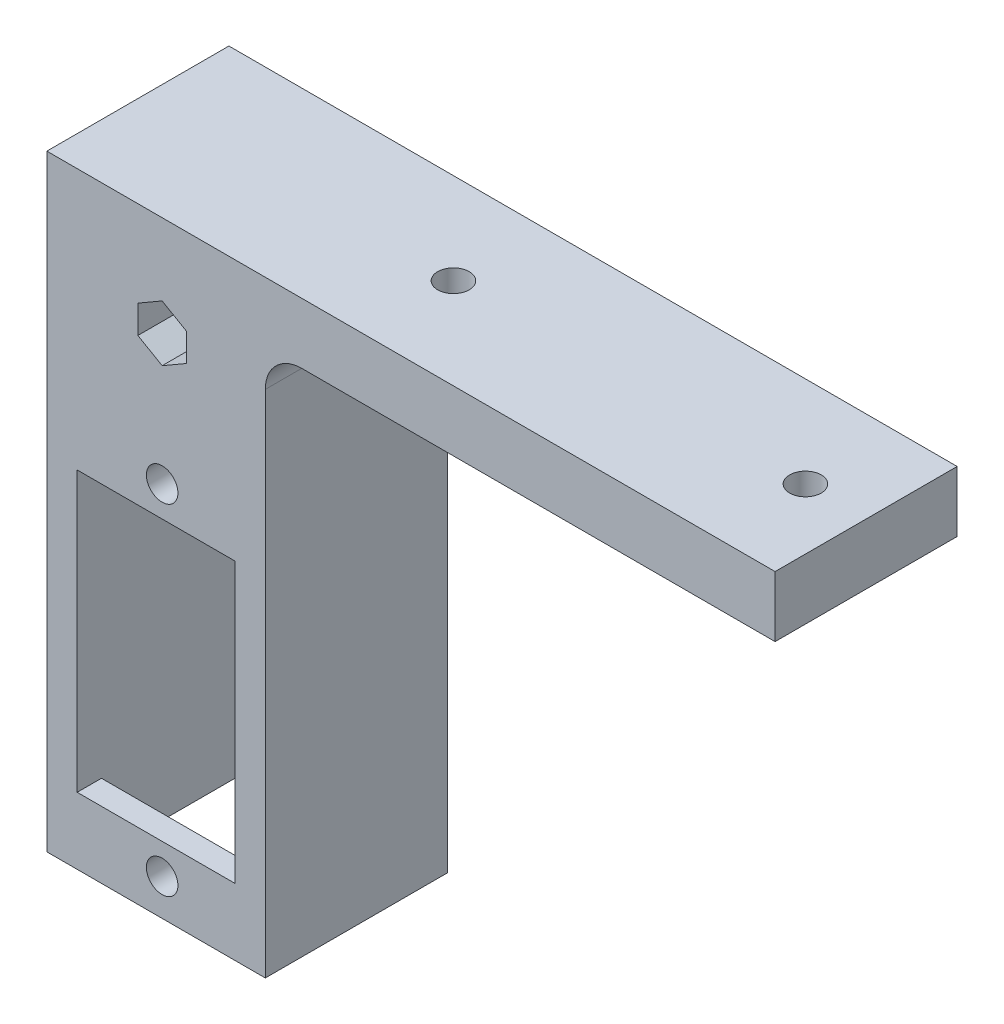
ISO-10303-21;
HEADER;
FILE_DESCRIPTION(('STEP AP214'),'2;1');
FILE_NAME('part.step','',(''),(''),'','','');
FILE_SCHEMA(('AUTOMOTIVE_DESIGN { 1 0 10303 214 1 1 1 1 }'));
ENDSEC;
DATA;
#1=APPLICATION_CONTEXT('core data for automotive mechanical design processes');
#2=APPLICATION_PROTOCOL_DEFINITION('international standard','automotive_design',2000,#1);
#3=PRODUCT_CONTEXT('',#1,'mechanical');
#4=PRODUCT('Part','Part','',(#3));
#5=PRODUCT_RELATED_PRODUCT_CATEGORY('part','',(#4));
#6=PRODUCT_DEFINITION_FORMATION('','',#4);
#7=PRODUCT_DEFINITION_CONTEXT('part definition',#1,'design');
#8=PRODUCT_DEFINITION('design','',#6,#7);
#9=PRODUCT_DEFINITION_SHAPE('','',#8);
#10=(LENGTH_UNIT() NAMED_UNIT(*) SI_UNIT(.MILLI.,.METRE.));
#11=(NAMED_UNIT(*) PLANE_ANGLE_UNIT() SI_UNIT($,.RADIAN.));
#12=(NAMED_UNIT(*) SI_UNIT($,.STERADIAN.) SOLID_ANGLE_UNIT());
#13=UNCERTAINTY_MEASURE_WITH_UNIT(LENGTH_MEASURE(1.E-05),#10,'distance_accuracy_value','');
#14=(GEOMETRIC_REPRESENTATION_CONTEXT(3) GLOBAL_UNCERTAINTY_ASSIGNED_CONTEXT((#13)) GLOBAL_UNIT_ASSIGNED_CONTEXT((#10,
#11,#12)) REPRESENTATION_CONTEXT('',''));
#15=CARTESIAN_POINT('',(0.,0.,0.));
#16=DIRECTION('',(0.,0.,1.));
#17=DIRECTION('',(1.,0.,0.));
#18=AXIS2_PLACEMENT_3D('',#15,#16,#17);
#19=CARTESIAN_POINT('',(-20.5000000000228,-5.75000000000239,15.001));
#20=DIRECTION('',(0.,0.,-1.));
#21=DIRECTION('',(-1.,0.,0.));
#22=AXIS2_PLACEMENT_3D('',#19,#20,#21);
#23=CYLINDRICAL_SURFACE('',#22,1.3);
#24=CARTESIAN_POINT('',(-20.5000000000228,-5.75000000000239,-4.));
#25=DIRECTION('',(0.,0.,-1.));
#26=DIRECTION('',(-1.,0.,0.));
#27=AXIS2_PLACEMENT_3D('',#24,#25,#26);
#28=CIRCLE('',#27,1.3);
#29=CARTESIAN_POINT('',(-21.8000000000228,-5.75000000000239,-4.));
#30=VERTEX_POINT('',#29);
#31=EDGE_CURVE('E238',#30,#30,#28,.T.);
#32=ORIENTED_EDGE('',*,*,#31,.T.);
#33=EDGE_LOOP('',(#32));
#34=FACE_BOUND('',#33,.T.);
#35=CARTESIAN_POINT('',(-20.5000000000228,-5.75000000000239,5.));
#36=DIRECTION('',(0.,0.,1.));
#37=DIRECTION('',(1.,0.,0.));
#38=AXIS2_PLACEMENT_3D('',#35,#36,#37);
#39=CIRCLE('',#38,1.3);
#40=CARTESIAN_POINT('',(-19.2000000000228,-5.75000000000239,5.));
#41=VERTEX_POINT('',#40);
#42=EDGE_CURVE('E230',#41,#41,#39,.F.);
#43=ORIENTED_EDGE('',*,*,#42,.F.);
#44=EDGE_LOOP('',(#43));
#45=FACE_BOUND('',#44,.T.);
#46=ADVANCED_FACE('F35',(#34,#45),#23,.F.);
#47=CARTESIAN_POINT('',(0.,0.,13.));
#48=DIRECTION('',(0.,0.,-1.));
#49=DIRECTION('',(-1.,0.,0.));
#50=AXIS2_PLACEMENT_3D('',#47,#48,#49);
#51=PLANE('',#50);
#52=CARTESIAN_POINT('',(-20.5,-16.5,13.));
#53=DIRECTION('',(0.,0.,-1.));
#54=DIRECTION('',(-1.,0.,0.));
#55=AXIS2_PLACEMENT_3D('',#52,#53,#54);
#56=CIRCLE('',#55,1.29999999999999);
#57=CARTESIAN_POINT('',(-21.8,-16.5,13.));
#58=VERTEX_POINT('',#57);
#59=EDGE_CURVE('E245',#58,#58,#56,.T.);
#60=ORIENTED_EDGE('',*,*,#59,.F.);
#61=EDGE_LOOP('',(#60));
#62=FACE_BOUND('',#61,.T.);
#63=DIRECTION('',(1.,0.,0.));
#64=VECTOR('',#63,1.);
#65=CARTESIAN_POINT('',(-14.5,-19.,13.));
#66=LINE('',#65,#64);
#67=CARTESIAN_POINT('',(-27.5,-19.,13.));
#68=VERTEX_POINT('',#67);
#69=CARTESIAN_POINT('',(-14.5,-19.,13.));
#70=VERTEX_POINT('',#69);
#71=EDGE_CURVE('E267',#68,#70,#66,.T.);
#72=ORIENTED_EDGE('',*,*,#71,.F.);
#73=DIRECTION('',(0.,1.,0.));
#74=VECTOR('',#73,1.);
#75=CARTESIAN_POINT('',(-27.5,-47.5,13.));
#76=LINE('',#75,#74);
#77=CARTESIAN_POINT('',(-27.5,-13.5,13.));
#78=VERTEX_POINT('',#77);
#79=EDGE_CURVE('E289',#68,#78,#76,.T.);
#80=ORIENTED_EDGE('',*,*,#79,.T.);
#81=DIRECTION('',(1.,0.,0.));
#82=VECTOR('',#81,1.);
#83=CARTESIAN_POINT('',(-27.5,-13.5,13.));
#84=LINE('',#83,#82);
#85=CARTESIAN_POINT('',(-14.5,-13.5,13.));
#86=VERTEX_POINT('',#85);
#87=EDGE_CURVE('E288',#78,#86,#84,.T.);
#88=ORIENTED_EDGE('',*,*,#87,.T.);
#89=DIRECTION('',(0.,1.,0.));
#90=VECTOR('',#89,1.);
#91=CARTESIAN_POINT('',(-14.5,-47.5,13.));
#92=LINE('',#91,#90);
#93=EDGE_CURVE('E292',#70,#86,#92,.T.);
#94=ORIENTED_EDGE('',*,*,#93,.F.);
#95=EDGE_LOOP('',(#72,#80,#88,#94));
#96=FACE_BOUND('',#95,.T.);
#97=ADVANCED_FACE('F401',(#62,#96),#51,.T.);
#98=CARTESIAN_POINT('',(30.,-2.5,15.));
#99=DIRECTION('',(-1.,0.,0.));
#100=DIRECTION('',(0.,0.,1.));
#101=AXIS2_PLACEMENT_3D('',#98,#99,#100);
#102=PLANE('',#101);
#103=DIRECTION('',(0.,1.,0.));
#104=VECTOR('',#103,1.);
#105=CARTESIAN_POINT('',(30.,-2.5,0.));
#106=LINE('',#105,#104);
#107=CARTESIAN_POINT('',(30.,-2.5,0.));
#108=VERTEX_POINT('',#107);
#109=CARTESIAN_POINT('',(30.,2.5,0.));
#110=VERTEX_POINT('',#109);
#111=EDGE_CURVE('E328',#108,#110,#106,.T.);
#112=ORIENTED_EDGE('',*,*,#111,.T.);
#113=DIRECTION('',(0.,0.,-1.));
#114=VECTOR('',#113,1.);
#115=CARTESIAN_POINT('',(30.,2.5,15.));
#116=LINE('',#115,#114);
#117=CARTESIAN_POINT('',(30.,2.5,15.));
#118=VERTEX_POINT('',#117);
#119=EDGE_CURVE('E369',#118,#110,#116,.T.);
#120=ORIENTED_EDGE('',*,*,#119,.F.);
#121=DIRECTION('',(0.,1.,0.));
#122=VECTOR('',#121,1.);
#123=CARTESIAN_POINT('',(30.,-2.5,15.));
#124=LINE('',#123,#122);
#125=CARTESIAN_POINT('',(30.,-2.5,15.));
#126=VERTEX_POINT('',#125);
#127=EDGE_CURVE('E329',#126,#118,#124,.T.);
#128=ORIENTED_EDGE('',*,*,#127,.F.);
#129=DIRECTION('',(0.,0.,-1.));
#130=VECTOR('',#129,1.);
#131=CARTESIAN_POINT('',(30.,-2.5,15.));
#132=LINE('',#131,#130);
#133=EDGE_CURVE('E343',#126,#108,#132,.T.);
#134=ORIENTED_EDGE('',*,*,#133,.T.);
#135=EDGE_LOOP('',(#112,#120,#128,#134));
#136=FACE_BOUND('',#135,.T.);
#137=ADVANCED_FACE('F389',(#136),#102,.F.);
#138=CARTESIAN_POINT('',(-30.,2.5,15.));
#139=DIRECTION('',(0.,-1.,0.));
#140=DIRECTION('',(0.,0.,-1.));
#141=AXIS2_PLACEMENT_3D('',#138,#139,#140);
#142=PLANE('',#141);
#143=CARTESIAN_POINT('',(25.,2.5,7.5));
#144=DIRECTION('',(0.,1.,0.));
#145=DIRECTION('',(0.,0.,1.));
#146=AXIS2_PLACEMENT_3D('',#143,#144,#145);
#147=CIRCLE('',#146,1.29999999999999);
#148=CARTESIAN_POINT('',(25.,2.5,8.79999999999999));
#149=VERTEX_POINT('',#148);
#150=EDGE_CURVE('E309',#149,#149,#147,.T.);
#151=ORIENTED_EDGE('',*,*,#150,.F.);
#152=EDGE_LOOP('',(#151));
#153=FACE_BOUND('',#152,.T.);
#154=CARTESIAN_POINT('',(-4.,2.5,7.5));
#155=DIRECTION('',(0.,1.,0.));
#156=DIRECTION('',(0.,0.,1.));
#157=AXIS2_PLACEMENT_3D('',#154,#155,#156);
#158=CIRCLE('',#157,1.29999999999999);
#159=CARTESIAN_POINT('',(-4.,2.5,8.79999999999999));
#160=VERTEX_POINT('',#159);
#161=EDGE_CURVE('E322',#160,#160,#158,.T.);
#162=ORIENTED_EDGE('',*,*,#161,.F.);
#163=EDGE_LOOP('',(#162));
#164=FACE_BOUND('',#163,.T.);
#165=DIRECTION('',(-1.,0.,0.));
#166=VECTOR('',#165,1.);
#167=CARTESIAN_POINT('',(-30.,2.5,0.));
#168=LINE('',#167,#166);
#169=CARTESIAN_POINT('',(-30.,2.5,0.));
#170=VERTEX_POINT('',#169);
#171=EDGE_CURVE('E346',#110,#170,#168,.T.);
#172=ORIENTED_EDGE('',*,*,#171,.T.);
#173=DIRECTION('',(0.,0.,-1.));
#174=VECTOR('',#173,1.);
#175=CARTESIAN_POINT('',(-30.,2.5,15.));
#176=LINE('',#175,#174);
#177=CARTESIAN_POINT('',(-30.,2.5,15.));
#178=VERTEX_POINT('',#177);
#179=EDGE_CURVE('E366',#178,#170,#176,.T.);
#180=ORIENTED_EDGE('',*,*,#179,.F.);
#181=DIRECTION('',(-1.,0.,0.));
#182=VECTOR('',#181,1.);
#183=CARTESIAN_POINT('',(-30.,2.5,15.));
#184=LINE('',#183,#182);
#185=EDGE_CURVE('E332',#118,#178,#184,.T.);
#186=ORIENTED_EDGE('',*,*,#185,.F.);
#187=ORIENTED_EDGE('',*,*,#119,.T.);
#188=EDGE_LOOP('',(#172,#180,#186,#187));
#189=FACE_BOUND('',#188,.T.);
#190=ADVANCED_FACE('F478',(#153,#164,#189),#142,.F.);
#191=CARTESIAN_POINT('',(-30.,-2.5,15.));
#192=DIRECTION('',(1.,0.,0.));
#193=DIRECTION('',(0.,1.,0.));
#194=AXIS2_PLACEMENT_3D('',#191,#192,#193);
#195=PLANE('',#194);
#196=DIRECTION('',(0.,-1.,0.));
#197=VECTOR('',#196,1.);
#198=CARTESIAN_POINT('',(-30.,-2.5,0.));
#199=LINE('',#198,#197);
#200=CARTESIAN_POINT('',(-30.,-47.5,0.));
#201=VERTEX_POINT('',#200);
#202=EDGE_CURVE('E349',#170,#201,#199,.T.);
#203=ORIENTED_EDGE('',*,*,#202,.T.);
#204=DIRECTION('',(0.,0.,-1.));
#205=VECTOR('',#204,1.);
#206=CARTESIAN_POINT('',(-30.,-47.5,15.));
#207=LINE('',#206,#205);
#208=CARTESIAN_POINT('',(-30.,-47.5,15.));
#209=VERTEX_POINT('',#208);
#210=EDGE_CURVE('E363',#209,#201,#207,.T.);
#211=ORIENTED_EDGE('',*,*,#210,.F.);
#212=DIRECTION('',(0.,-1.,0.));
#213=VECTOR('',#212,1.);
#214=CARTESIAN_POINT('',(-30.,-2.5,15.));
#215=LINE('',#214,#213);
#216=EDGE_CURVE('E335',#178,#209,#215,.T.);
#217=ORIENTED_EDGE('',*,*,#216,.F.);
#218=ORIENTED_EDGE('',*,*,#179,.T.);
#219=EDGE_LOOP('',(#203,#211,#217,#218));
#220=FACE_BOUND('',#219,.T.);
#221=ADVANCED_FACE('F474',(#220),#195,.F.);
#222=CARTESIAN_POINT('',(-30.,-47.5,15.));
#223=DIRECTION('',(0.,1.,0.));
#224=DIRECTION('',(-1.,0.,0.));
#225=AXIS2_PLACEMENT_3D('',#222,#223,#224);
#226=PLANE('',#225);
#227=DIRECTION('',(1.,0.,0.));
#228=VECTOR('',#227,1.);
#229=CARTESIAN_POINT('',(-30.,-47.5,0.));
#230=LINE('',#229,#228);
#231=CARTESIAN_POINT('',(-27.5,-47.5,0.));
#232=VERTEX_POINT('',#231);
#233=EDGE_CURVE('E352',#201,#232,#230,.T.);
#234=ORIENTED_EDGE('',*,*,#233,.T.);
#235=DIRECTION('',(0.,0.,-1.));
#236=VECTOR('',#235,1.);
#237=CARTESIAN_POINT('',(-27.5,-47.5,13.));
#238=LINE('',#237,#236);
#239=CARTESIAN_POINT('',(-27.5,-47.5,13.));
#240=VERTEX_POINT('',#239);
#241=EDGE_CURVE('E307',#240,#232,#238,.T.);
#242=ORIENTED_EDGE('',*,*,#241,.F.);
#243=DIRECTION('',(1.,0.,0.));
#244=VECTOR('',#243,1.);
#245=CARTESIAN_POINT('',(-27.5,-47.5,13.));
#246=LINE('',#245,#244);
#247=CARTESIAN_POINT('',(-14.5,-47.5,13.));
#248=VERTEX_POINT('',#247);
#249=EDGE_CURVE('E296',#240,#248,#246,.T.);
#250=ORIENTED_EDGE('',*,*,#249,.T.);
#251=DIRECTION('',(0.,0.,-1.));
#252=VECTOR('',#251,1.);
#253=CARTESIAN_POINT('',(-14.5,-47.5,13.));
#254=LINE('',#253,#252);
#255=CARTESIAN_POINT('',(-14.5,-47.5,0.));
#256=VERTEX_POINT('',#255);
#257=EDGE_CURVE('E310',#248,#256,#254,.T.);
#258=ORIENTED_EDGE('',*,*,#257,.T.);
#259=CARTESIAN_POINT('',(-12.,-47.5,0.));
#260=VERTEX_POINT('',#259);
#261=EDGE_CURVE('E351',#256,#260,#230,.T.);
#262=ORIENTED_EDGE('',*,*,#261,.T.);
#263=DIRECTION('',(0.,0.,-1.));
#264=VECTOR('',#263,1.);
#265=CARTESIAN_POINT('',(-12.,-47.5,15.));
#266=LINE('',#265,#264);
#267=CARTESIAN_POINT('',(-12.,-47.5,15.));
#268=VERTEX_POINT('',#267);
#269=EDGE_CURVE('E360',#268,#260,#266,.T.);
#270=ORIENTED_EDGE('',*,*,#269,.F.);
#271=DIRECTION('',(1.,0.,0.));
#272=VECTOR('',#271,1.);
#273=CARTESIAN_POINT('',(-30.,-47.5,15.));
#274=LINE('',#273,#272);
#275=EDGE_CURVE('E337',#209,#268,#274,.T.);
#276=ORIENTED_EDGE('',*,*,#275,.F.);
#277=ORIENTED_EDGE('',*,*,#210,.T.);
#278=EDGE_LOOP('',(#234,#242,#250,#258,#262,#270,#276,#277));
#279=FACE_BOUND('',#278,.T.);
#280=ADVANCED_FACE('F471',(#279),#226,.F.);
#281=CARTESIAN_POINT('',(-12.,-47.5,15.));
#282=DIRECTION('',(-1.,0.,0.));
#283=DIRECTION('',(0.,0.,1.));
#284=AXIS2_PLACEMENT_3D('',#281,#282,#283);
#285=PLANE('',#284);
#286=DIRECTION('',(0.,1.,0.));
#287=VECTOR('',#286,1.);
#288=CARTESIAN_POINT('',(-12.,-47.5,0.));
#289=LINE('',#288,#287);
#290=CARTESIAN_POINT('',(-12.,-5.50000000000001,0.));
#291=VERTEX_POINT('',#290);
#292=EDGE_CURVE('E355',#260,#291,#289,.T.);
#293=ORIENTED_EDGE('',*,*,#292,.T.);
#294=DIRECTION('',(0.,0.,-1.));
#295=VECTOR('',#294,1.);
#296=CARTESIAN_POINT('',(-12.,-5.5,15.));
#297=LINE('',#296,#295);
#298=CARTESIAN_POINT('',(-12.,-5.50000000000001,15.));
#299=VERTEX_POINT('',#298);
#300=EDGE_CURVE('E50',#291,#299,#297,.F.);
#301=ORIENTED_EDGE('',*,*,#300,.T.);
#302=DIRECTION('',(0.,1.,0.));
#303=VECTOR('',#302,1.);
#304=CARTESIAN_POINT('',(-12.,-47.5,15.));
#305=LINE('',#304,#303);
#306=EDGE_CURVE('E339',#268,#299,#305,.T.);
#307=ORIENTED_EDGE('',*,*,#306,.F.);
#308=ORIENTED_EDGE('',*,*,#269,.T.);
#309=EDGE_LOOP('',(#293,#301,#307,#308));
#310=FACE_BOUND('',#309,.T.);
#311=ADVANCED_FACE('F467',(#310),#285,.F.);
#312=CARTESIAN_POINT('',(-12.,-2.5,15.));
#313=DIRECTION('',(0.,1.,0.));
#314=DIRECTION('',(0.,0.,1.));
#315=AXIS2_PLACEMENT_3D('',#312,#313,#314);
#316=PLANE('',#315);
#317=CARTESIAN_POINT('',(25.,-2.5,7.5));
#318=DIRECTION('',(0.,1.,0.));
#319=DIRECTION('',(0.,0.,1.));
#320=AXIS2_PLACEMENT_3D('',#317,#318,#319);
#321=CIRCLE('',#320,1.29999999999999);
#322=CARTESIAN_POINT('',(25.,-2.5,8.79999999999999));
#323=VERTEX_POINT('',#322);
#324=EDGE_CURVE('E319',#323,#323,#321,.T.);
#325=ORIENTED_EDGE('',*,*,#324,.T.);
#326=EDGE_LOOP('',(#325));
#327=FACE_BOUND('',#326,.T.);
#328=CARTESIAN_POINT('',(-4.,-2.5,7.5));
#329=DIRECTION('',(0.,1.,0.));
#330=DIRECTION('',(0.,0.,1.));
#331=AXIS2_PLACEMENT_3D('',#328,#329,#330);
#332=CIRCLE('',#331,1.29999999999999);
#333=CARTESIAN_POINT('',(-4.,-2.5,8.79999999999999));
#334=VERTEX_POINT('',#333);
#335=EDGE_CURVE('E325',#334,#334,#332,.T.);
#336=ORIENTED_EDGE('',*,*,#335,.T.);
#337=EDGE_LOOP('',(#336));
#338=FACE_BOUND('',#337,.T.);
#339=DIRECTION('',(1.,0.,0.));
#340=VECTOR('',#339,1.);
#341=CARTESIAN_POINT('',(-12.,-2.5,15.));
#342=LINE('',#341,#340);
#343=CARTESIAN_POINT('',(-8.99999999999999,-2.5,15.));
#344=VERTEX_POINT('',#343);
#345=EDGE_CURVE('E341',#344,#126,#342,.T.);
#346=ORIENTED_EDGE('',*,*,#345,.F.);
#347=DIRECTION('',(0.,0.,-1.));
#348=VECTOR('',#347,1.);
#349=CARTESIAN_POINT('',(-8.99999999999999,-2.5,0.));
#350=LINE('',#349,#348);
#351=CARTESIAN_POINT('',(-8.99999999999999,-2.5,0.));
#352=VERTEX_POINT('',#351);
#353=EDGE_CURVE('E372',#344,#352,#350,.T.);
#354=ORIENTED_EDGE('',*,*,#353,.T.);
#355=DIRECTION('',(1.,0.,0.));
#356=VECTOR('',#355,1.);
#357=CARTESIAN_POINT('',(-12.,-2.5,0.));
#358=LINE('',#357,#356);
#359=EDGE_CURVE('E333',#352,#108,#358,.T.);
#360=ORIENTED_EDGE('',*,*,#359,.T.);
#361=ORIENTED_EDGE('',*,*,#133,.F.);
#362=EDGE_LOOP('',(#346,#354,#360,#361));
#363=FACE_BOUND('',#362,.T.);
#364=ADVANCED_FACE('F380',(#327,#338,#363),#316,.F.);
#365=CARTESIAN_POINT('',(0.,0.,15.));
#366=DIRECTION('',(0.,0.,-1.));
#367=DIRECTION('',(-1.,0.,0.));
#368=AXIS2_PLACEMENT_3D('',#365,#366,#367);
#369=PLANE('',#368);
#370=DIRECTION('',(-0.866025403784439,-0.5,0.));
#371=VECTOR('',#370,1.);
#372=CARTESIAN_POINT('',(-20.5000000000228,-3.44059892324389,15.));
#373=LINE('',#372,#371);
#374=CARTESIAN_POINT('',(-20.5000000000228,-3.44059892324388,15.));
#375=VERTEX_POINT('',#374);
#376=CARTESIAN_POINT('',(-22.5000000000228,-4.59529946162314,15.));
#377=VERTEX_POINT('',#376);
#378=EDGE_CURVE('E218',#375,#377,#373,.T.);
#379=ORIENTED_EDGE('',*,*,#378,.F.);
#380=DIRECTION('',(-0.866025403784439,0.5,0.));
#381=VECTOR('',#380,1.);
#382=CARTESIAN_POINT('',(-18.5000000000228,-4.59529946162314,15.));
#383=LINE('',#382,#381);
#384=CARTESIAN_POINT('',(-18.5000000000228,-4.59529946162314,15.));
#385=VERTEX_POINT('',#384);
#386=EDGE_CURVE('E185',#385,#375,#383,.T.);
#387=ORIENTED_EDGE('',*,*,#386,.F.);
#388=DIRECTION('',(0.,1.,0.));
#389=VECTOR('',#388,1.);
#390=CARTESIAN_POINT('',(-18.5000000000228,-6.90470053838165,15.));
#391=LINE('',#390,#389);
#392=CARTESIAN_POINT('',(-18.5000000000228,-6.90470053838165,15.));
#393=VERTEX_POINT('',#392);
#394=EDGE_CURVE('E204',#393,#385,#391,.T.);
#395=ORIENTED_EDGE('',*,*,#394,.F.);
#396=DIRECTION('',(0.866025403784439,0.5,0.));
#397=VECTOR('',#396,1.);
#398=CARTESIAN_POINT('',(-20.5000000000228,-8.0594010767609,15.));
#399=LINE('',#398,#397);
#400=CARTESIAN_POINT('',(-20.5000000000228,-8.0594010767609,15.));
#401=VERTEX_POINT('',#400);
#402=EDGE_CURVE('E207',#401,#393,#399,.T.);
#403=ORIENTED_EDGE('',*,*,#402,.F.);
#404=DIRECTION('',(0.866025403784438,-0.5,0.));
#405=VECTOR('',#404,1.);
#406=CARTESIAN_POINT('',(-22.5000000000228,-6.90470053838164,15.));
#407=LINE('',#406,#405);
#408=CARTESIAN_POINT('',(-22.5000000000228,-6.90470053838164,15.));
#409=VERTEX_POINT('',#408);
#410=EDGE_CURVE('E223',#409,#401,#407,.T.);
#411=ORIENTED_EDGE('',*,*,#410,.F.);
#412=DIRECTION('',(0.,-1.,0.));
#413=VECTOR('',#412,1.);
#414=CARTESIAN_POINT('',(-22.5000000000228,-4.59529946162314,15.));
#415=LINE('',#414,#413);
#416=EDGE_CURVE('E220',#377,#409,#415,.T.);
#417=ORIENTED_EDGE('',*,*,#416,.F.);
#418=EDGE_LOOP('',(#379,#387,#395,#403,#411,#417));
#419=FACE_BOUND('',#418,.T.);
#420=CARTESIAN_POINT('',(-20.5,-16.5,15.));
#421=DIRECTION('',(0.,0.,-1.));
#422=DIRECTION('',(-1.,0.,0.));
#423=AXIS2_PLACEMENT_3D('',#420,#421,#422);
#424=CIRCLE('',#423,1.29999999999999);
#425=CARTESIAN_POINT('',(-21.8,-16.5,15.));
#426=VERTEX_POINT('',#425);
#427=EDGE_CURVE('E250',#426,#426,#424,.T.);
#428=ORIENTED_EDGE('',*,*,#427,.T.);
#429=EDGE_LOOP('',(#428));
#430=FACE_BOUND('',#429,.T.);
#431=CARTESIAN_POINT('',(-20.5,-44.5,15.));
#432=DIRECTION('',(0.,0.,-1.));
#433=DIRECTION('',(-1.,0.,0.));
#434=AXIS2_PLACEMENT_3D('',#431,#432,#433);
#435=CIRCLE('',#434,1.29999999999999);
#436=CARTESIAN_POINT('',(-21.8,-44.5,15.));
#437=VERTEX_POINT('',#436);
#438=EDGE_CURVE('E256',#437,#437,#435,.T.);
#439=ORIENTED_EDGE('',*,*,#438,.T.);
#440=EDGE_LOOP('',(#439));
#441=FACE_BOUND('',#440,.T.);
#442=DIRECTION('',(0.,-1.,0.));
#443=VECTOR('',#442,1.);
#444=CARTESIAN_POINT('',(-27.5,-42.,15.));
#445=LINE('',#444,#443);
#446=CARTESIAN_POINT('',(-27.5,-19.,15.));
#447=VERTEX_POINT('',#446);
#448=CARTESIAN_POINT('',(-27.5,-42.,15.));
#449=VERTEX_POINT('',#448);
#450=EDGE_CURVE('E261',#447,#449,#445,.T.);
#451=ORIENTED_EDGE('',*,*,#450,.F.);
#452=DIRECTION('',(-1.,0.,0.));
#453=VECTOR('',#452,1.);
#454=CARTESIAN_POINT('',(-14.5,-19.,15.));
#455=LINE('',#454,#453);
#456=CARTESIAN_POINT('',(-14.5,-19.,15.));
#457=VERTEX_POINT('',#456);
#458=EDGE_CURVE('E264',#457,#447,#455,.T.);
#459=ORIENTED_EDGE('',*,*,#458,.F.);
#460=DIRECTION('',(0.,1.,0.));
#461=VECTOR('',#460,1.);
#462=CARTESIAN_POINT('',(-14.5,-42.,15.));
#463=LINE('',#462,#461);
#464=CARTESIAN_POINT('',(-14.5,-42.,15.));
#465=VERTEX_POINT('',#464);
#466=EDGE_CURVE('E275',#465,#457,#463,.T.);
#467=ORIENTED_EDGE('',*,*,#466,.F.);
#468=DIRECTION('',(1.,0.,0.));
#469=VECTOR('',#468,1.);
#470=CARTESIAN_POINT('',(-14.5,-42.,15.));
#471=LINE('',#470,#469);
#472=EDGE_CURVE('E259',#449,#465,#471,.T.);
#473=ORIENTED_EDGE('',*,*,#472,.F.);
#474=EDGE_LOOP('',(#451,#459,#467,#473));
#475=FACE_BOUND('',#474,.T.);
#476=ORIENTED_EDGE('',*,*,#127,.T.);
#477=ORIENTED_EDGE('',*,*,#185,.T.);
#478=ORIENTED_EDGE('',*,*,#216,.T.);
#479=ORIENTED_EDGE('',*,*,#275,.T.);
#480=ORIENTED_EDGE('',*,*,#306,.T.);
#481=CARTESIAN_POINT('',(-8.99999999999999,-5.5,15.));
#482=DIRECTION('',(0.,0.,-1.));
#483=DIRECTION('',(-1.,0.,0.));
#484=AXIS2_PLACEMENT_3D('',#481,#482,#483);
#485=CIRCLE('',#484,3.);
#486=EDGE_CURVE('E11',#299,#344,#485,.T.);
#487=ORIENTED_EDGE('',*,*,#486,.T.);
#488=ORIENTED_EDGE('',*,*,#345,.T.);
#489=EDGE_LOOP('',(#476,#477,#478,#479,#480,#487,#488));
#490=FACE_BOUND('',#489,.T.);
#491=ADVANCED_FACE('F392',(#419,#430,#441,#475,#490),#369,.F.);
#492=CARTESIAN_POINT('',(0.,0.,0.));
#493=DIRECTION('',(0.,0.,-1.));
#494=DIRECTION('',(-1.,0.,0.));
#495=AXIS2_PLACEMENT_3D('',#492,#493,#494);
#496=PLANE('',#495);
#497=CARTESIAN_POINT('',(-20.5000000000228,-5.7500000000135,0.));
#498=DIRECTION('',(0.,0.,-1.));
#499=DIRECTION('',(-1.,0.,0.));
#500=AXIS2_PLACEMENT_3D('',#497,#498,#499);
#501=CIRCLE('',#500,3.3);
#502=CARTESIAN_POINT('',(-23.8000000000228,-5.7500000000135,0.));
#503=VERTEX_POINT('',#502);
#504=EDGE_CURVE('E241',#503,#503,#501,.T.);
#505=ORIENTED_EDGE('',*,*,#504,.F.);
#506=EDGE_LOOP('',(#505));
#507=FACE_BOUND('',#506,.T.);
#508=DIRECTION('',(0.,1.,0.));
#509=VECTOR('',#508,1.);
#510=CARTESIAN_POINT('',(-27.5,-47.5,0.));
#511=LINE('',#510,#509);
#512=CARTESIAN_POINT('',(-27.5,-13.5,0.));
#513=VERTEX_POINT('',#512);
#514=EDGE_CURVE('E284',#232,#513,#511,.T.);
#515=ORIENTED_EDGE('',*,*,#514,.F.);
#516=ORIENTED_EDGE('',*,*,#233,.F.);
#517=ORIENTED_EDGE('',*,*,#202,.F.);
#518=ORIENTED_EDGE('',*,*,#171,.F.);
#519=ORIENTED_EDGE('',*,*,#111,.F.);
#520=ORIENTED_EDGE('',*,*,#359,.F.);
#521=CARTESIAN_POINT('',(-8.99999999999999,-5.5,0.));
#522=DIRECTION('',(0.,0.,-1.));
#523=DIRECTION('',(-1.,0.,0.));
#524=AXIS2_PLACEMENT_3D('',#521,#522,#523);
#525=CIRCLE('',#524,3.);
#526=EDGE_CURVE('E43',#352,#291,#525,.F.);
#527=ORIENTED_EDGE('',*,*,#526,.T.);
#528=ORIENTED_EDGE('',*,*,#292,.F.);
#529=ORIENTED_EDGE('',*,*,#261,.F.);
#530=DIRECTION('',(0.,1.,0.));
#531=VECTOR('',#530,1.);
#532=CARTESIAN_POINT('',(-14.5,-47.5,0.));
#533=LINE('',#532,#531);
#534=CARTESIAN_POINT('',(-14.5,-13.5,0.));
#535=VERTEX_POINT('',#534);
#536=EDGE_CURVE('E304',#256,#535,#533,.T.);
#537=ORIENTED_EDGE('',*,*,#536,.T.);
#538=DIRECTION('',(1.,0.,0.));
#539=VECTOR('',#538,1.);
#540=CARTESIAN_POINT('',(-27.5,-13.5,0.));
#541=LINE('',#540,#539);
#542=EDGE_CURVE('E301',#513,#535,#541,.T.);
#543=ORIENTED_EDGE('',*,*,#542,.F.);
#544=EDGE_LOOP('',(#515,#516,#517,#518,#519,#520,#527,#528,#529,#537,#543));
#545=FACE_BOUND('',#544,.T.);
#546=ADVANCED_FACE('F386',(#507,#545),#496,.T.);
#547=CARTESIAN_POINT('',(-4.,2.5,7.5));
#548=DIRECTION('',(0.,1.,0.));
#549=DIRECTION('',(0.,0.,1.));
#550=AXIS2_PLACEMENT_3D('',#547,#548,#549);
#551=CYLINDRICAL_SURFACE('',#550,1.29999999999999);
#552=ORIENTED_EDGE('',*,*,#335,.F.);
#553=EDGE_LOOP('',(#552));
#554=FACE_BOUND('',#553,.T.);
#555=ORIENTED_EDGE('',*,*,#161,.T.);
#556=EDGE_LOOP('',(#555));
#557=FACE_BOUND('',#556,.T.);
#558=ADVANCED_FACE('F454',(#554,#557),#551,.F.);
#559=CARTESIAN_POINT('',(25.,2.5,7.5));
#560=DIRECTION('',(0.,1.,0.));
#561=DIRECTION('',(0.,0.,1.));
#562=AXIS2_PLACEMENT_3D('',#559,#560,#561);
#563=CYLINDRICAL_SURFACE('',#562,1.29999999999999);
#564=ORIENTED_EDGE('',*,*,#324,.F.);
#565=EDGE_LOOP('',(#564));
#566=FACE_BOUND('',#565,.T.);
#567=ORIENTED_EDGE('',*,*,#150,.T.);
#568=EDGE_LOOP('',(#567));
#569=FACE_BOUND('',#568,.T.);
#570=ADVANCED_FACE('F450',(#566,#569),#563,.F.);
#571=CARTESIAN_POINT('',(-27.5,-47.5,13.));
#572=DIRECTION('',(-1.,0.,0.));
#573=DIRECTION('',(0.,0.,1.));
#574=AXIS2_PLACEMENT_3D('',#571,#572,#573);
#575=PLANE('',#574);
#576=ORIENTED_EDGE('',*,*,#514,.T.);
#577=DIRECTION('',(0.,0.,-1.));
#578=VECTOR('',#577,1.);
#579=CARTESIAN_POINT('',(-27.5,-13.5,13.));
#580=LINE('',#579,#578);
#581=EDGE_CURVE('E299',#78,#513,#580,.T.);
#582=ORIENTED_EDGE('',*,*,#581,.F.);
#583=ORIENTED_EDGE('',*,*,#79,.F.);
#584=DIRECTION('',(0.,0.,-1.));
#585=VECTOR('',#584,1.);
#586=CARTESIAN_POINT('',(-27.5,-19.,15.001));
#587=LINE('',#586,#585);
#588=EDGE_CURVE('E273',#447,#68,#587,.T.);
#589=ORIENTED_EDGE('',*,*,#588,.F.);
#590=ORIENTED_EDGE('',*,*,#450,.T.);
#591=DIRECTION('',(0.,0.,-1.));
#592=VECTOR('',#591,1.);
#593=CARTESIAN_POINT('',(-27.5,-42.,15.001));
#594=LINE('',#593,#592);
#595=CARTESIAN_POINT('',(-27.5,-42.,13.));
#596=VERTEX_POINT('',#595);
#597=EDGE_CURVE('E276',#449,#596,#594,.T.);
#598=ORIENTED_EDGE('',*,*,#597,.T.);
#599=EDGE_CURVE('E285',#240,#596,#76,.T.);
#600=ORIENTED_EDGE('',*,*,#599,.F.);
#601=ORIENTED_EDGE('',*,*,#241,.T.);
#602=EDGE_LOOP('',(#576,#582,#583,#589,#590,#598,#600,#601));
#603=FACE_BOUND('',#602,.T.);
#604=ADVANCED_FACE('F443',(#603),#575,.F.);
#605=CARTESIAN_POINT('',(-14.5,-47.5,13.));
#606=DIRECTION('',(-1.,0.,0.));
#607=DIRECTION('',(0.,0.,1.));
#608=AXIS2_PLACEMENT_3D('',#605,#606,#607);
#609=PLANE('',#608);
#610=ORIENTED_EDGE('',*,*,#536,.F.);
#611=ORIENTED_EDGE('',*,*,#257,.F.);
#612=CARTESIAN_POINT('',(-14.5,-42.,13.));
#613=VERTEX_POINT('',#612);
#614=EDGE_CURVE('E293',#248,#613,#92,.T.);
#615=ORIENTED_EDGE('',*,*,#614,.T.);
#616=DIRECTION('',(0.,0.,-1.));
#617=VECTOR('',#616,1.);
#618=CARTESIAN_POINT('',(-14.5,-42.,15.001));
#619=LINE('',#618,#617);
#620=EDGE_CURVE('E278',#465,#613,#619,.T.);
#621=ORIENTED_EDGE('',*,*,#620,.F.);
#622=ORIENTED_EDGE('',*,*,#466,.T.);
#623=DIRECTION('',(0.,0.,-1.));
#624=VECTOR('',#623,1.);
#625=CARTESIAN_POINT('',(-14.5,-19.,15.001));
#626=LINE('',#625,#624);
#627=EDGE_CURVE('E272',#457,#70,#626,.T.);
#628=ORIENTED_EDGE('',*,*,#627,.T.);
#629=ORIENTED_EDGE('',*,*,#93,.T.);
#630=DIRECTION('',(0.,0.,-1.));
#631=VECTOR('',#630,1.);
#632=CARTESIAN_POINT('',(-14.5,-13.5,13.));
#633=LINE('',#632,#631);
#634=EDGE_CURVE('E313',#86,#535,#633,.T.);
#635=ORIENTED_EDGE('',*,*,#634,.T.);
#636=EDGE_LOOP('',(#610,#611,#615,#621,#622,#628,#629,#635));
#637=FACE_BOUND('',#636,.T.);
#638=ADVANCED_FACE('F440',(#637),#609,.T.);
#639=CARTESIAN_POINT('',(-27.5,-13.5,13.));
#640=DIRECTION('',(0.,1.,0.));
#641=DIRECTION('',(-1.,0.,0.));
#642=AXIS2_PLACEMENT_3D('',#639,#640,#641);
#643=PLANE('',#642);
#644=ORIENTED_EDGE('',*,*,#542,.T.);
#645=ORIENTED_EDGE('',*,*,#634,.F.);
#646=ORIENTED_EDGE('',*,*,#87,.F.);
#647=ORIENTED_EDGE('',*,*,#581,.T.);
#648=EDGE_LOOP('',(#644,#645,#646,#647));
#649=FACE_BOUND('',#648,.T.);
#650=ADVANCED_FACE('F438',(#649),#643,.F.);
#651=CARTESIAN_POINT('',(-20.5,-44.5,13.));
#652=DIRECTION('',(0.,0.,-1.));
#653=DIRECTION('',(-1.,0.,0.));
#654=AXIS2_PLACEMENT_3D('',#651,#652,#653);
#655=CIRCLE('',#654,1.29999999999999);
#656=CARTESIAN_POINT('',(-21.8,-44.5,13.));
#657=VERTEX_POINT('',#656);
#658=EDGE_CURVE('E253',#657,#657,#655,.T.);
#659=ORIENTED_EDGE('',*,*,#658,.F.);
#660=EDGE_LOOP('',(#659));
#661=FACE_BOUND('',#660,.T.);
#662=DIRECTION('',(-1.,0.,0.));
#663=VECTOR('',#662,1.);
#664=CARTESIAN_POINT('',(-14.5,-42.,13.));
#665=LINE('',#664,#663);
#666=EDGE_CURVE('E269',#613,#596,#665,.T.);
#667=ORIENTED_EDGE('',*,*,#666,.F.);
#668=ORIENTED_EDGE('',*,*,#614,.F.);
#669=ORIENTED_EDGE('',*,*,#249,.F.);
#670=ORIENTED_EDGE('',*,*,#599,.T.);
#671=EDGE_LOOP('',(#667,#668,#669,#670));
#672=FACE_BOUND('',#671,.T.);
#673=ADVANCED_FACE('F409',(#661,#672),#51,.T.);
#674=CARTESIAN_POINT('',(-14.5,-19.,15.001));
#675=DIRECTION('',(0.,1.,0.));
#676=DIRECTION('',(0.,0.,1.));
#677=AXIS2_PLACEMENT_3D('',#674,#675,#676);
#678=PLANE('',#677);
#679=ORIENTED_EDGE('',*,*,#458,.T.);
#680=ORIENTED_EDGE('',*,*,#588,.T.);
#681=ORIENTED_EDGE('',*,*,#71,.T.);
#682=ORIENTED_EDGE('',*,*,#627,.F.);
#683=EDGE_LOOP('',(#679,#680,#681,#682));
#684=FACE_BOUND('',#683,.T.);
#685=ADVANCED_FACE('F432',(#684),#678,.F.);
#686=CARTESIAN_POINT('',(-14.5,-42.,15.001));
#687=DIRECTION('',(0.,-1.,0.));
#688=DIRECTION('',(0.,0.,-1.));
#689=AXIS2_PLACEMENT_3D('',#686,#687,#688);
#690=PLANE('',#689);
#691=ORIENTED_EDGE('',*,*,#472,.T.);
#692=ORIENTED_EDGE('',*,*,#620,.T.);
#693=ORIENTED_EDGE('',*,*,#666,.T.);
#694=ORIENTED_EDGE('',*,*,#597,.F.);
#695=EDGE_LOOP('',(#691,#692,#693,#694));
#696=FACE_BOUND('',#695,.T.);
#697=ADVANCED_FACE('F428',(#696),#690,.F.);
#698=CARTESIAN_POINT('',(-20.5,-44.5,13.));
#699=DIRECTION('',(0.,0.,-1.));
#700=DIRECTION('',(-1.,0.,0.));
#701=AXIS2_PLACEMENT_3D('',#698,#699,#700);
#702=CYLINDRICAL_SURFACE('',#701,1.29999999999999);
#703=ORIENTED_EDGE('',*,*,#438,.F.);
#704=EDGE_LOOP('',(#703));
#705=FACE_BOUND('',#704,.T.);
#706=ORIENTED_EDGE('',*,*,#658,.T.);
#707=EDGE_LOOP('',(#706));
#708=FACE_BOUND('',#707,.T.);
#709=ADVANCED_FACE('F424',(#705,#708),#702,.F.);
#710=CARTESIAN_POINT('',(-20.5,-16.5,13.));
#711=DIRECTION('',(0.,0.,-1.));
#712=DIRECTION('',(-1.,0.,0.));
#713=AXIS2_PLACEMENT_3D('',#710,#711,#712);
#714=CYLINDRICAL_SURFACE('',#713,1.29999999999999);
#715=ORIENTED_EDGE('',*,*,#427,.F.);
#716=EDGE_LOOP('',(#715));
#717=FACE_BOUND('',#716,.T.);
#718=ORIENTED_EDGE('',*,*,#59,.T.);
#719=EDGE_LOOP('',(#718));
#720=FACE_BOUND('',#719,.T.);
#721=ADVANCED_FACE('F420',(#717,#720),#714,.F.);
#722=CARTESIAN_POINT('',(-20.5000000000228,-5.7500000000135,-4.));
#723=DIRECTION('',(0.,0.,1.));
#724=DIRECTION('',(1.,0.,0.));
#725=AXIS2_PLACEMENT_3D('',#722,#723,#724);
#726=CYLINDRICAL_SURFACE('',#725,3.3);
#727=CARTESIAN_POINT('',(-20.5000000000228,-5.7500000000135,-4.));
#728=DIRECTION('',(0.,0.,-1.));
#729=DIRECTION('',(-1.,0.,0.));
#730=AXIS2_PLACEMENT_3D('',#727,#728,#729);
#731=CIRCLE('',#730,3.3);
#732=CARTESIAN_POINT('',(-23.8000000000228,-5.7500000000135,-4.));
#733=VERTEX_POINT('',#732);
#734=EDGE_CURVE('E242',#733,#733,#731,.T.);
#735=ORIENTED_EDGE('',*,*,#734,.F.);
#736=EDGE_LOOP('',(#735));
#737=FACE_BOUND('',#736,.T.);
#738=ORIENTED_EDGE('',*,*,#504,.T.);
#739=EDGE_LOOP('',(#738));
#740=FACE_BOUND('',#739,.T.);
#741=ADVANCED_FACE('F416',(#737,#740),#726,.T.);
#742=CARTESIAN_POINT('',(-20.5000000000228,-5.7500000000135,-4.));
#743=DIRECTION('',(0.,0.,-1.));
#744=DIRECTION('',(-1.,0.,0.));
#745=AXIS2_PLACEMENT_3D('',#742,#743,#744);
#746=PLANE('',#745);
#747=ORIENTED_EDGE('',*,*,#31,.F.);
#748=EDGE_LOOP('',(#747));
#749=FACE_BOUND('',#748,.T.);
#750=ORIENTED_EDGE('',*,*,#734,.T.);
#751=EDGE_LOOP('',(#750));
#752=FACE_BOUND('',#751,.T.);
#753=ADVANCED_FACE('F413',(#749,#752),#746,.T.);
#754=CARTESIAN_POINT('',(0.,0.,5.));
#755=DIRECTION('',(0.,0.,1.));
#756=DIRECTION('',(1.,0.,0.));
#757=AXIS2_PLACEMENT_3D('',#754,#755,#756);
#758=PLANE('',#757);
#759=DIRECTION('',(-0.866025403784439,0.5,0.));
#760=VECTOR('',#759,1.);
#761=CARTESIAN_POINT('',(-18.5000000000228,-4.59529946162314,5.));
#762=LINE('',#761,#760);
#763=CARTESIAN_POINT('',(-18.5000000000228,-4.59529946162314,5.));
#764=VERTEX_POINT('',#763);
#765=CARTESIAN_POINT('',(-20.5000000000228,-3.44059892324389,5.));
#766=VERTEX_POINT('',#765);
#767=EDGE_CURVE('E182',#764,#766,#762,.T.);
#768=ORIENTED_EDGE('',*,*,#767,.T.);
#769=DIRECTION('',(-0.866025403784439,-0.5,0.));
#770=VECTOR('',#769,1.);
#771=CARTESIAN_POINT('',(-20.5000000000228,-3.44059892324389,5.));
#772=LINE('',#771,#770);
#773=CARTESIAN_POINT('',(-22.5000000000228,-4.59529946162314,5.));
#774=VERTEX_POINT('',#773);
#775=EDGE_CURVE('E193',#766,#774,#772,.T.);
#776=ORIENTED_EDGE('',*,*,#775,.T.);
#777=DIRECTION('',(0.,-1.,0.));
#778=VECTOR('',#777,1.);
#779=CARTESIAN_POINT('',(-22.5000000000228,-4.59529946162314,5.));
#780=LINE('',#779,#778);
#781=CARTESIAN_POINT('',(-22.5000000000228,-6.90470053838164,5.));
#782=VERTEX_POINT('',#781);
#783=EDGE_CURVE('E198',#774,#782,#780,.T.);
#784=ORIENTED_EDGE('',*,*,#783,.T.);
#785=DIRECTION('',(0.866025403784438,-0.5,0.));
#786=VECTOR('',#785,1.);
#787=CARTESIAN_POINT('',(-22.5000000000228,-6.90470053838164,5.));
#788=LINE('',#787,#786);
#789=CARTESIAN_POINT('',(-20.5000000000228,-8.0594010767609,5.));
#790=VERTEX_POINT('',#789);
#791=EDGE_CURVE('E211',#782,#790,#788,.T.);
#792=ORIENTED_EDGE('',*,*,#791,.T.);
#793=DIRECTION('',(0.866025403784439,0.5,0.));
#794=VECTOR('',#793,1.);
#795=CARTESIAN_POINT('',(-20.5000000000228,-8.0594010767609,5.));
#796=LINE('',#795,#794);
#797=CARTESIAN_POINT('',(-18.5000000000228,-6.90470053838165,5.));
#798=VERTEX_POINT('',#797);
#799=EDGE_CURVE('E214',#790,#798,#796,.T.);
#800=ORIENTED_EDGE('',*,*,#799,.T.);
#801=DIRECTION('',(0.,1.,0.));
#802=VECTOR('',#801,1.);
#803=CARTESIAN_POINT('',(-18.5000000000228,-6.90470053838165,5.));
#804=LINE('',#803,#802);
#805=EDGE_CURVE('E190',#798,#764,#804,.T.);
#806=ORIENTED_EDGE('',*,*,#805,.T.);
#807=EDGE_LOOP('',(#768,#776,#784,#792,#800,#806));
#808=FACE_BOUND('',#807,.T.);
#809=ORIENTED_EDGE('',*,*,#42,.T.);
#810=EDGE_LOOP('',(#809));
#811=FACE_BOUND('',#810,.T.);
#812=ADVANCED_FACE('F200',(#808,#811),#758,.T.);
#813=CARTESIAN_POINT('',(-18.5000000000228,-4.59529946162314,5.));
#814=DIRECTION('',(0.5,0.866025403784439,0.));
#815=DIRECTION('',(-0.866025403784439,0.5,0.));
#816=AXIS2_PLACEMENT_3D('',#813,#814,#815);
#817=PLANE('',#816);
#818=ORIENTED_EDGE('',*,*,#386,.T.);
#819=DIRECTION('',(0.,0.,1.));
#820=VECTOR('',#819,1.);
#821=CARTESIAN_POINT('',(-20.5000000000228,-3.44059892324389,5.));
#822=LINE('',#821,#820);
#823=EDGE_CURVE('E178',#766,#375,#822,.T.);
#824=ORIENTED_EDGE('',*,*,#823,.F.);
#825=ORIENTED_EDGE('',*,*,#767,.F.);
#826=DIRECTION('',(0.,0.,1.));
#827=VECTOR('',#826,1.);
#828=CARTESIAN_POINT('',(-18.5000000000228,-4.59529946162314,5.));
#829=LINE('',#828,#827);
#830=EDGE_CURVE('E228',#764,#385,#829,.T.);
#831=ORIENTED_EDGE('',*,*,#830,.T.);
#832=EDGE_LOOP('',(#818,#824,#825,#831));
#833=FACE_BOUND('',#832,.T.);
#834=ADVANCED_FACE('F180',(#833),#817,.F.);
#835=CARTESIAN_POINT('',(-18.5000000000228,-6.90470053838165,5.));
#836=DIRECTION('',(1.,0.,0.));
#837=DIRECTION('',(0.,0.,-1.));
#838=AXIS2_PLACEMENT_3D('',#835,#836,#837);
#839=PLANE('',#838);
#840=ORIENTED_EDGE('',*,*,#394,.T.);
#841=ORIENTED_EDGE('',*,*,#830,.F.);
#842=ORIENTED_EDGE('',*,*,#805,.F.);
#843=DIRECTION('',(0.,0.,1.));
#844=VECTOR('',#843,1.);
#845=CARTESIAN_POINT('',(-18.5000000000228,-6.90470053838165,5.));
#846=LINE('',#845,#844);
#847=EDGE_CURVE('E231',#798,#393,#846,.T.);
#848=ORIENTED_EDGE('',*,*,#847,.T.);
#849=EDGE_LOOP('',(#840,#841,#842,#848));
#850=FACE_BOUND('',#849,.T.);
#851=ADVANCED_FACE('F576',(#850),#839,.F.);
#852=CARTESIAN_POINT('',(-20.5000000000228,-8.0594010767609,5.));
#853=DIRECTION('',(0.5,-0.866025403784439,0.));
#854=DIRECTION('',(0.866025403784439,0.5,0.));
#855=AXIS2_PLACEMENT_3D('',#852,#853,#854);
#856=PLANE('',#855);
#857=ORIENTED_EDGE('',*,*,#402,.T.);
#858=ORIENTED_EDGE('',*,*,#847,.F.);
#859=ORIENTED_EDGE('',*,*,#799,.F.);
#860=DIRECTION('',(0.,0.,1.));
#861=VECTOR('',#860,1.);
#862=CARTESIAN_POINT('',(-20.5000000000228,-8.0594010767609,5.));
#863=LINE('',#862,#861);
#864=EDGE_CURVE('E233',#790,#401,#863,.T.);
#865=ORIENTED_EDGE('',*,*,#864,.T.);
#866=EDGE_LOOP('',(#857,#858,#859,#865));
#867=FACE_BOUND('',#866,.T.);
#868=ADVANCED_FACE('F582',(#867),#856,.F.);
#869=CARTESIAN_POINT('',(-22.5000000000228,-6.90470053838164,5.));
#870=DIRECTION('',(-0.5,-0.866025403784438,0.));
#871=DIRECTION('',(0.866025403784438,-0.500000000000001,0.));
#872=AXIS2_PLACEMENT_3D('',#869,#870,#871);
#873=PLANE('',#872);
#874=ORIENTED_EDGE('',*,*,#410,.T.);
#875=ORIENTED_EDGE('',*,*,#864,.F.);
#876=ORIENTED_EDGE('',*,*,#791,.F.);
#877=DIRECTION('',(0.,0.,1.));
#878=VECTOR('',#877,1.);
#879=CARTESIAN_POINT('',(-22.5000000000228,-6.90470053838164,5.));
#880=LINE('',#879,#878);
#881=EDGE_CURVE('E235',#782,#409,#880,.T.);
#882=ORIENTED_EDGE('',*,*,#881,.T.);
#883=EDGE_LOOP('',(#874,#875,#876,#882));
#884=FACE_BOUND('',#883,.T.);
#885=ADVANCED_FACE('F590',(#884),#873,.F.);
#886=CARTESIAN_POINT('',(-22.5000000000228,-4.59529946162314,5.));
#887=DIRECTION('',(-1.,0.,0.));
#888=DIRECTION('',(0.,0.,1.));
#889=AXIS2_PLACEMENT_3D('',#886,#887,#888);
#890=PLANE('',#889);
#891=ORIENTED_EDGE('',*,*,#416,.T.);
#892=ORIENTED_EDGE('',*,*,#881,.F.);
#893=ORIENTED_EDGE('',*,*,#783,.F.);
#894=DIRECTION('',(0.,0.,1.));
#895=VECTOR('',#894,1.);
#896=CARTESIAN_POINT('',(-22.5000000000228,-4.59529946162314,5.));
#897=LINE('',#896,#895);
#898=EDGE_CURVE('E189',#774,#377,#897,.T.);
#899=ORIENTED_EDGE('',*,*,#898,.T.);
#900=EDGE_LOOP('',(#891,#892,#893,#899));
#901=FACE_BOUND('',#900,.T.);
#902=ADVANCED_FACE('F398',(#901),#890,.F.);
#903=CARTESIAN_POINT('',(-20.5000000000228,-3.44059892324389,5.));
#904=DIRECTION('',(-0.5,0.866025403784439,0.));
#905=DIRECTION('',(-0.866025403784439,-0.5,0.));
#906=AXIS2_PLACEMENT_3D('',#903,#904,#905);
#907=PLANE('',#906);
#908=ORIENTED_EDGE('',*,*,#378,.T.);
#909=ORIENTED_EDGE('',*,*,#898,.F.);
#910=ORIENTED_EDGE('',*,*,#775,.F.);
#911=ORIENTED_EDGE('',*,*,#823,.T.);
#912=EDGE_LOOP('',(#908,#909,#910,#911));
#913=FACE_BOUND('',#912,.T.);
#914=ADVANCED_FACE('F194',(#913),#907,.F.);
#915=CARTESIAN_POINT('',(-8.99999999999999,-5.5,15.));
#916=DIRECTION('',(0.,0.,1.));
#917=DIRECTION('',(1.,0.,0.));
#918=AXIS2_PLACEMENT_3D('',#915,#916,#917);
#919=CYLINDRICAL_SURFACE('',#918,3.);
#920=ORIENTED_EDGE('',*,*,#486,.F.);
#921=ORIENTED_EDGE('',*,*,#300,.F.);
#922=ORIENTED_EDGE('',*,*,#526,.F.);
#923=ORIENTED_EDGE('',*,*,#353,.F.);
#924=EDGE_LOOP('',(#920,#921,#922,#923));
#925=FACE_BOUND('',#924,.T.);
#926=ADVANCED_FACE('F37',(#925),#919,.F.);
#927=CLOSED_SHELL('',(#46,#97,#137,#190,#221,#280,#311,#364,#491,#546,#558,#570,#604,#638,#650,
#673,#685,#697,#709,#721,#741,#753,#812,#834,#851,#868,#885,#902,#914,#926));
#928=MANIFOLD_SOLID_BREP('B2',#927);
#929=ADVANCED_BREP_SHAPE_REPRESENTATION('',(#18,#928),#14);
#930=SHAPE_DEFINITION_REPRESENTATION(#9,#929);
ENDSEC;
END-ISO-10303-21;
